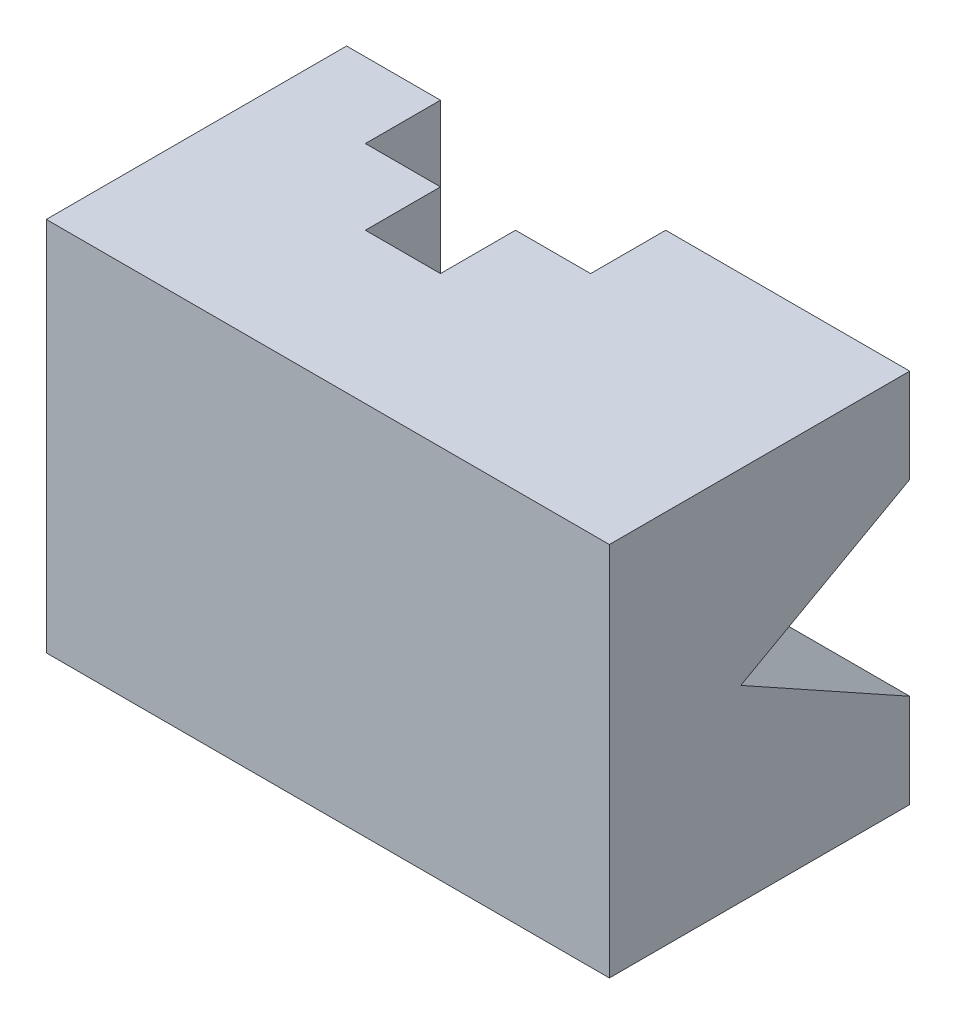
ISO-10303-21;
HEADER;
FILE_DESCRIPTION(('STEP AP214'),'2;1');
FILE_NAME('part.step','',(''),(''),'','','');
FILE_SCHEMA(('AUTOMOTIVE_DESIGN { 1 0 10303 214 1 1 1 1 }'));
ENDSEC;
DATA;
#1=APPLICATION_CONTEXT('core data for automotive mechanical design processes');
#2=APPLICATION_PROTOCOL_DEFINITION('international standard','automotive_design',2000,#1);
#3=PRODUCT_CONTEXT('',#1,'mechanical');
#4=PRODUCT('Part','Part','',(#3));
#5=PRODUCT_RELATED_PRODUCT_CATEGORY('part','',(#4));
#6=PRODUCT_DEFINITION_FORMATION('','',#4);
#7=PRODUCT_DEFINITION_CONTEXT('part definition',#1,'design');
#8=PRODUCT_DEFINITION('design','',#6,#7);
#9=PRODUCT_DEFINITION_SHAPE('','',#8);
#10=(LENGTH_UNIT() NAMED_UNIT(*) SI_UNIT(.MILLI.,.METRE.));
#11=(NAMED_UNIT(*) PLANE_ANGLE_UNIT() SI_UNIT($,.RADIAN.));
#12=(NAMED_UNIT(*) SI_UNIT($,.STERADIAN.) SOLID_ANGLE_UNIT());
#13=UNCERTAINTY_MEASURE_WITH_UNIT(LENGTH_MEASURE(1.E-05),#10,'distance_accuracy_value','');
#14=(GEOMETRIC_REPRESENTATION_CONTEXT(3) GLOBAL_UNCERTAINTY_ASSIGNED_CONTEXT((#13)) GLOBAL_UNIT_ASSIGNED_CONTEXT((#10,
#11,#12)) REPRESENTATION_CONTEXT('',''));
#15=CARTESIAN_POINT('',(0.,0.,0.));
#16=DIRECTION('',(0.,0.,1.));
#17=DIRECTION('',(1.,0.,0.));
#18=AXIS2_PLACEMENT_3D('',#15,#16,#17);
#19=CARTESIAN_POINT('',(9.99999999999998,100.,0.));
#20=DIRECTION('',(-1.,0.,0.));
#21=DIRECTION('',(0.,0.,1.));
#22=AXIS2_PLACEMENT_3D('',#19,#20,#21);
#23=PLANE('',#22);
#24=DIRECTION('',(0.,0.,-1.));
#25=VECTOR('',#24,1.);
#26=CARTESIAN_POINT('',(9.99999999999998,0.,0.));
#27=LINE('',#26,#25);
#28=CARTESIAN_POINT('',(9.99999999999999,0.,-20.));
#29=VERTEX_POINT('',#28);
#30=CARTESIAN_POINT('',(9.99999999999999,0.,-40.));
#31=VERTEX_POINT('',#30);
#32=EDGE_CURVE('E184',#29,#31,#27,.T.);
#33=ORIENTED_EDGE('',*,*,#32,.F.);
#34=DIRECTION('',(0.,-1.,0.));
#35=VECTOR('',#34,1.);
#36=CARTESIAN_POINT('',(9.99999999999999,100.,-20.));
#37=LINE('',#36,#35);
#38=CARTESIAN_POINT('',(9.99999999999999,100.,-20.));
#39=VERTEX_POINT('',#38);
#40=EDGE_CURVE('E11',#39,#29,#37,.T.);
#41=ORIENTED_EDGE('',*,*,#40,.F.);
#42=DIRECTION('',(0.,0.,-1.));
#43=VECTOR('',#42,1.);
#44=CARTESIAN_POINT('',(9.99999999999998,100.,0.));
#45=LINE('',#44,#43);
#46=CARTESIAN_POINT('',(9.99999999999999,100.,-40.));
#47=VERTEX_POINT('',#46);
#48=EDGE_CURVE('E280',#39,#47,#45,.T.);
#49=ORIENTED_EDGE('',*,*,#48,.T.);
#50=DIRECTION('',(0.,-1.,0.));
#51=VECTOR('',#50,1.);
#52=CARTESIAN_POINT('',(9.99999999999999,100.,-40.));
#53=LINE('',#52,#51);
#54=EDGE_CURVE('E69',#47,#31,#53,.T.);
#55=ORIENTED_EDGE('',*,*,#54,.T.);
#56=EDGE_LOOP('',(#33,#41,#49,#55));
#57=FACE_BOUND('',#56,.T.);
#58=ADVANCED_FACE('F45',(#57),#23,.T.);
#59=CARTESIAN_POINT('',(0.,100.,-20.));
#60=DIRECTION('',(0.,0.,-1.));
#61=DIRECTION('',(-1.,0.,0.));
#62=AXIS2_PLACEMENT_3D('',#59,#60,#61);
#63=PLANE('',#62);
#64=DIRECTION('',(1.,0.,0.));
#65=VECTOR('',#64,1.);
#66=CARTESIAN_POINT('',(0.,0.,-20.));
#67=LINE('',#66,#65);
#68=CARTESIAN_POINT('',(-10.,0.,-20.));
#69=VERTEX_POINT('',#68);
#70=EDGE_CURVE('E187',#69,#29,#67,.T.);
#71=ORIENTED_EDGE('',*,*,#70,.F.);
#72=DIRECTION('',(0.,-1.,0.));
#73=VECTOR('',#72,1.);
#74=CARTESIAN_POINT('',(-10.,100.,-20.));
#75=LINE('',#74,#73);
#76=CARTESIAN_POINT('',(-10.,100.,-20.));
#77=VERTEX_POINT('',#76);
#78=EDGE_CURVE('E53',#77,#69,#75,.T.);
#79=ORIENTED_EDGE('',*,*,#78,.F.);
#80=DIRECTION('',(1.,0.,0.));
#81=VECTOR('',#80,1.);
#82=CARTESIAN_POINT('',(0.,100.,-20.));
#83=LINE('',#82,#81);
#84=EDGE_CURVE('E273',#77,#39,#83,.T.);
#85=ORIENTED_EDGE('',*,*,#84,.T.);
#86=ORIENTED_EDGE('',*,*,#40,.T.);
#87=EDGE_LOOP('',(#71,#79,#85,#86));
#88=FACE_BOUND('',#87,.T.);
#89=ADVANCED_FACE('F261',(#88),#63,.T.);
#90=CARTESIAN_POINT('',(-10.,100.,0.));
#91=DIRECTION('',(-1.,0.,0.));
#92=DIRECTION('',(0.,0.,1.));
#93=AXIS2_PLACEMENT_3D('',#90,#91,#92);
#94=PLANE('',#93);
#95=DIRECTION('',(0.,0.,-1.));
#96=VECTOR('',#95,1.);
#97=CARTESIAN_POINT('',(-10.,0.,0.));
#98=LINE('',#97,#96);
#99=CARTESIAN_POINT('',(-10.,0.,0.));
#100=VERTEX_POINT('',#99);
#101=EDGE_CURVE('E192',#100,#69,#98,.T.);
#102=ORIENTED_EDGE('',*,*,#101,.F.);
#103=DIRECTION('',(0.,-1.,0.));
#104=VECTOR('',#103,1.);
#105=CARTESIAN_POINT('',(-10.,100.,0.));
#106=LINE('',#105,#104);
#107=CARTESIAN_POINT('',(-10.,100.,0.));
#108=VERTEX_POINT('',#107);
#109=EDGE_CURVE('E248',#108,#100,#106,.T.);
#110=ORIENTED_EDGE('',*,*,#109,.F.);
#111=DIRECTION('',(0.,0.,-1.));
#112=VECTOR('',#111,1.);
#113=CARTESIAN_POINT('',(-10.,100.,0.));
#114=LINE('',#113,#112);
#115=EDGE_CURVE('E257',#108,#77,#114,.T.);
#116=ORIENTED_EDGE('',*,*,#115,.T.);
#117=ORIENTED_EDGE('',*,*,#78,.T.);
#118=EDGE_LOOP('',(#102,#110,#116,#117));
#119=FACE_BOUND('',#118,.T.);
#120=ADVANCED_FACE('F255',(#119),#94,.T.);
#121=CARTESIAN_POINT('',(0.,100.,0.));
#122=DIRECTION('',(0.,0.,-1.));
#123=DIRECTION('',(-1.,0.,0.));
#124=AXIS2_PLACEMENT_3D('',#121,#122,#123);
#125=PLANE('',#124);
#126=DIRECTION('',(1.,0.,0.));
#127=VECTOR('',#126,1.);
#128=CARTESIAN_POINT('',(0.,0.,0.));
#129=LINE('',#128,#127);
#130=CARTESIAN_POINT('',(-30.,0.,0.));
#131=VERTEX_POINT('',#130);
#132=EDGE_CURVE('E196',#131,#100,#129,.T.);
#133=ORIENTED_EDGE('',*,*,#132,.F.);
#134=DIRECTION('',(0.,-1.,0.));
#135=VECTOR('',#134,1.);
#136=CARTESIAN_POINT('',(-30.,100.,0.));
#137=LINE('',#136,#135);
#138=CARTESIAN_POINT('',(-30.,100.,0.));
#139=VERTEX_POINT('',#138);
#140=EDGE_CURVE('E245',#139,#131,#137,.T.);
#141=ORIENTED_EDGE('',*,*,#140,.F.);
#142=DIRECTION('',(1.,0.,0.));
#143=VECTOR('',#142,1.);
#144=CARTESIAN_POINT('',(0.,100.,0.));
#145=LINE('',#144,#143);
#146=EDGE_CURVE('E270',#139,#108,#145,.T.);
#147=ORIENTED_EDGE('',*,*,#146,.T.);
#148=ORIENTED_EDGE('',*,*,#109,.T.);
#149=EDGE_LOOP('',(#133,#141,#147,#148));
#150=FACE_BOUND('',#149,.T.);
#151=ADVANCED_FACE('F267',(#150),#125,.T.);
#152=CARTESIAN_POINT('',(-30.,100.,0.));
#153=DIRECTION('',(1.,0.,0.));
#154=DIRECTION('',(0.,0.,-1.));
#155=AXIS2_PLACEMENT_3D('',#152,#153,#154);
#156=PLANE('',#155);
#157=DIRECTION('',(0.,0.,1.));
#158=VECTOR('',#157,1.);
#159=CARTESIAN_POINT('',(-30.,0.,0.));
#160=LINE('',#159,#158);
#161=CARTESIAN_POINT('',(-30.,0.,-20.));
#162=VERTEX_POINT('',#161);
#163=EDGE_CURVE('E200',#162,#131,#160,.T.);
#164=ORIENTED_EDGE('',*,*,#163,.F.);
#165=DIRECTION('',(0.,-1.,0.));
#166=VECTOR('',#165,1.);
#167=CARTESIAN_POINT('',(-30.,100.,-20.));
#168=LINE('',#167,#166);
#169=CARTESIAN_POINT('',(-30.,100.,-20.));
#170=VERTEX_POINT('',#169);
#171=EDGE_CURVE('E242',#170,#162,#168,.T.);
#172=ORIENTED_EDGE('',*,*,#171,.F.);
#173=DIRECTION('',(0.,0.,1.));
#174=VECTOR('',#173,1.);
#175=CARTESIAN_POINT('',(-30.,100.,0.));
#176=LINE('',#175,#174);
#177=EDGE_CURVE('E278',#170,#139,#176,.T.);
#178=ORIENTED_EDGE('',*,*,#177,.T.);
#179=ORIENTED_EDGE('',*,*,#140,.T.);
#180=EDGE_LOOP('',(#164,#172,#178,#179));
#181=FACE_BOUND('',#180,.T.);
#182=ADVANCED_FACE('F368',(#181),#156,.T.);
#183=CARTESIAN_POINT('',(0.,100.,-20.));
#184=DIRECTION('',(0.,0.,-1.));
#185=DIRECTION('',(-1.,0.,0.));
#186=AXIS2_PLACEMENT_3D('',#183,#184,#185);
#187=PLANE('',#186);
#188=DIRECTION('',(1.,0.,0.));
#189=VECTOR('',#188,1.);
#190=CARTESIAN_POINT('',(0.,0.,-20.));
#191=LINE('',#190,#189);
#192=CARTESIAN_POINT('',(-50.,0.,-20.));
#193=VERTEX_POINT('',#192);
#194=EDGE_CURVE('E204',#193,#162,#191,.T.);
#195=ORIENTED_EDGE('',*,*,#194,.F.);
#196=DIRECTION('',(0.,-1.,0.));
#197=VECTOR('',#196,1.);
#198=CARTESIAN_POINT('',(-50.,100.,-20.));
#199=LINE('',#198,#197);
#200=CARTESIAN_POINT('',(-50.,100.,-20.));
#201=VERTEX_POINT('',#200);
#202=EDGE_CURVE('E239',#201,#193,#199,.T.);
#203=ORIENTED_EDGE('',*,*,#202,.F.);
#204=DIRECTION('',(1.,0.,0.));
#205=VECTOR('',#204,1.);
#206=CARTESIAN_POINT('',(0.,100.,-20.));
#207=LINE('',#206,#205);
#208=EDGE_CURVE('E286',#201,#170,#207,.T.);
#209=ORIENTED_EDGE('',*,*,#208,.T.);
#210=ORIENTED_EDGE('',*,*,#171,.T.);
#211=EDGE_LOOP('',(#195,#203,#209,#210));
#212=FACE_BOUND('',#211,.T.);
#213=ADVANCED_FACE('F371',(#212),#187,.T.);
#214=CARTESIAN_POINT('',(-50.,100.,0.));
#215=DIRECTION('',(1.,0.,0.));
#216=DIRECTION('',(0.,0.,-1.));
#217=AXIS2_PLACEMENT_3D('',#214,#215,#216);
#218=PLANE('',#217);
#219=DIRECTION('',(0.,0.,1.));
#220=VECTOR('',#219,1.);
#221=CARTESIAN_POINT('',(-50.,0.,0.));
#222=LINE('',#221,#220);
#223=CARTESIAN_POINT('',(-50.,0.,-40.));
#224=VERTEX_POINT('',#223);
#225=EDGE_CURVE('E208',#224,#193,#222,.T.);
#226=ORIENTED_EDGE('',*,*,#225,.F.);
#227=DIRECTION('',(0.,-1.,0.));
#228=VECTOR('',#227,1.);
#229=CARTESIAN_POINT('',(-50.,100.,-40.));
#230=LINE('',#229,#228);
#231=CARTESIAN_POINT('',(-50.,100.,-40.));
#232=VERTEX_POINT('',#231);
#233=EDGE_CURVE('E236',#232,#224,#230,.T.);
#234=ORIENTED_EDGE('',*,*,#233,.F.);
#235=DIRECTION('',(0.,0.,1.));
#236=VECTOR('',#235,1.);
#237=CARTESIAN_POINT('',(-50.,100.,0.));
#238=LINE('',#237,#236);
#239=EDGE_CURVE('E290',#232,#201,#238,.T.);
#240=ORIENTED_EDGE('',*,*,#239,.T.);
#241=ORIENTED_EDGE('',*,*,#202,.T.);
#242=EDGE_LOOP('',(#226,#234,#240,#241));
#243=FACE_BOUND('',#242,.T.);
#244=ADVANCED_FACE('F375',(#243),#218,.T.);
#245=CARTESIAN_POINT('',(0.,100.,-40.));
#246=DIRECTION('',(0.,0.,-1.));
#247=DIRECTION('',(-1.,0.,0.));
#248=AXIS2_PLACEMENT_3D('',#245,#246,#247);
#249=PLANE('',#248);
#250=DIRECTION('',(1.,0.,0.));
#251=VECTOR('',#250,1.);
#252=CARTESIAN_POINT('',(0.,0.,-40.));
#253=LINE('',#252,#251);
#254=CARTESIAN_POINT('',(-75.,0.,-40.));
#255=VERTEX_POINT('',#254);
#256=EDGE_CURVE('E212',#255,#224,#253,.T.);
#257=ORIENTED_EDGE('',*,*,#256,.F.);
#258=DIRECTION('',(0.,-1.,0.));
#259=VECTOR('',#258,1.);
#260=CARTESIAN_POINT('',(-75.,100.,-40.));
#261=LINE('',#260,#259);
#262=CARTESIAN_POINT('',(-75.,100.,-40.));
#263=VERTEX_POINT('',#262);
#264=EDGE_CURVE('E233',#263,#255,#261,.T.);
#265=ORIENTED_EDGE('',*,*,#264,.F.);
#266=DIRECTION('',(1.,0.,0.));
#267=VECTOR('',#266,1.);
#268=CARTESIAN_POINT('',(0.,100.,-40.));
#269=LINE('',#268,#267);
#270=EDGE_CURVE('E181',#263,#232,#269,.T.);
#271=ORIENTED_EDGE('',*,*,#270,.T.);
#272=ORIENTED_EDGE('',*,*,#233,.T.);
#273=EDGE_LOOP('',(#257,#265,#271,#272));
#274=FACE_BOUND('',#273,.T.);
#275=ADVANCED_FACE('F379',(#274),#249,.T.);
#276=CARTESIAN_POINT('',(-75.,100.,0.));
#277=DIRECTION('',(-1.,0.,0.));
#278=DIRECTION('',(0.,0.,1.));
#279=AXIS2_PLACEMENT_3D('',#276,#277,#278);
#280=PLANE('',#279);
#281=DIRECTION('',(0.,0.,-1.));
#282=VECTOR('',#281,1.);
#283=CARTESIAN_POINT('',(-75.,0.,0.));
#284=LINE('',#283,#282);
#285=CARTESIAN_POINT('',(-75.,0.,40.));
#286=VERTEX_POINT('',#285);
#287=EDGE_CURVE('E216',#286,#255,#284,.T.);
#288=ORIENTED_EDGE('',*,*,#287,.F.);
#289=DIRECTION('',(0.,-1.,0.));
#290=VECTOR('',#289,1.);
#291=CARTESIAN_POINT('',(-75.,100.,40.));
#292=LINE('',#291,#290);
#293=CARTESIAN_POINT('',(-75.,100.,40.));
#294=VERTEX_POINT('',#293);
#295=EDGE_CURVE('E169',#294,#286,#292,.T.);
#296=ORIENTED_EDGE('',*,*,#295,.F.);
#297=DIRECTION('',(0.,0.,-1.));
#298=VECTOR('',#297,1.);
#299=CARTESIAN_POINT('',(-75.,100.,0.));
#300=LINE('',#299,#298);
#301=EDGE_CURVE('E156',#294,#263,#300,.T.);
#302=ORIENTED_EDGE('',*,*,#301,.T.);
#303=ORIENTED_EDGE('',*,*,#264,.T.);
#304=EDGE_LOOP('',(#288,#296,#302,#303));
#305=FACE_BOUND('',#304,.T.);
#306=ADVANCED_FACE('F298',(#305),#280,.T.);
#307=CARTESIAN_POINT('',(0.,100.,40.));
#308=DIRECTION('',(0.,0.,-1.));
#309=DIRECTION('',(-1.,0.,0.));
#310=AXIS2_PLACEMENT_3D('',#307,#308,#309);
#311=PLANE('',#310);
#312=DIRECTION('',(1.,0.,0.));
#313=VECTOR('',#312,1.);
#314=CARTESIAN_POINT('',(0.,0.,40.));
#315=LINE('',#314,#313);
#316=CARTESIAN_POINT('',(75.,0.,40.));
#317=VERTEX_POINT('',#316);
#318=EDGE_CURVE('E164',#286,#317,#315,.T.);
#319=ORIENTED_EDGE('',*,*,#318,.T.);
#320=DIRECTION('',(0.,-1.,0.));
#321=VECTOR('',#320,1.);
#322=CARTESIAN_POINT('',(75.,100.,40.));
#323=LINE('',#322,#321);
#324=CARTESIAN_POINT('',(75.,100.,40.));
#325=VERTEX_POINT('',#324);
#326=EDGE_CURVE('E161',#325,#317,#323,.T.);
#327=ORIENTED_EDGE('',*,*,#326,.F.);
#328=DIRECTION('',(1.,0.,0.));
#329=VECTOR('',#328,1.);
#330=CARTESIAN_POINT('',(0.,100.,40.));
#331=LINE('',#330,#329);
#332=EDGE_CURVE('E147',#294,#325,#331,.T.);
#333=ORIENTED_EDGE('',*,*,#332,.F.);
#334=ORIENTED_EDGE('',*,*,#295,.T.);
#335=EDGE_LOOP('',(#319,#327,#333,#334));
#336=FACE_BOUND('',#335,.T.);
#337=ADVANCED_FACE('F162',(#336),#311,.F.);
#338=CARTESIAN_POINT('',(75.,100.,0.));
#339=DIRECTION('',(-1.,0.,0.));
#340=DIRECTION('',(0.,0.,1.));
#341=AXIS2_PLACEMENT_3D('',#338,#339,#340);
#342=PLANE('',#341);
#343=DIRECTION('',(0.,-1.,0.));
#344=VECTOR('',#343,1.);
#345=CARTESIAN_POINT('',(75.,100.,-40.));
#346=LINE('',#345,#344);
#347=CARTESIAN_POINT('',(75.,25.,-40.));
#348=VERTEX_POINT('',#347);
#349=CARTESIAN_POINT('',(75.,0.,-40.));
#350=VERTEX_POINT('',#349);
#351=EDGE_CURVE('E228',#348,#350,#346,.T.);
#352=ORIENTED_EDGE('',*,*,#351,.F.);
#353=DIRECTION('',(0.,-0.485642931178632,-0.874157276121538));
#354=VECTOR('',#353,1.);
#355=CARTESIAN_POINT('',(75.,25.,-40.));
#356=LINE('',#355,#354);
#357=CARTESIAN_POINT('',(75.,50.,5.00000000000001));
#358=VERTEX_POINT('',#357);
#359=EDGE_CURVE('E304',#358,#348,#356,.T.);
#360=ORIENTED_EDGE('',*,*,#359,.F.);
#361=DIRECTION('',(0.,-0.485642931178632,0.874157276121538));
#362=VECTOR('',#361,1.);
#363=CARTESIAN_POINT('',(75.,75.,-40.));
#364=LINE('',#363,#362);
#365=CARTESIAN_POINT('',(75.,75.,-40.));
#366=VERTEX_POINT('',#365);
#367=EDGE_CURVE('E343',#366,#358,#364,.T.);
#368=ORIENTED_EDGE('',*,*,#367,.F.);
#369=CARTESIAN_POINT('',(75.,100.,-40.));
#370=VERTEX_POINT('',#369);
#371=EDGE_CURVE('E170',#370,#366,#346,.T.);
#372=ORIENTED_EDGE('',*,*,#371,.F.);
#373=DIRECTION('',(0.,0.,-1.));
#374=VECTOR('',#373,1.);
#375=CARTESIAN_POINT('',(75.,100.,0.));
#376=LINE('',#375,#374);
#377=EDGE_CURVE('E152',#325,#370,#376,.T.);
#378=ORIENTED_EDGE('',*,*,#377,.F.);
#379=ORIENTED_EDGE('',*,*,#326,.T.);
#380=DIRECTION('',(0.,0.,-1.));
#381=VECTOR('',#380,1.);
#382=CARTESIAN_POINT('',(75.,0.,0.));
#383=LINE('',#382,#381);
#384=EDGE_CURVE('E223',#317,#350,#383,.T.);
#385=ORIENTED_EDGE('',*,*,#384,.T.);
#386=EDGE_LOOP('',(#352,#360,#368,#372,#378,#379,#385));
#387=FACE_BOUND('',#386,.T.);
#388=ADVANCED_FACE('F173',(#387),#342,.F.);
#389=DIRECTION('',(1.,0.,0.));
#390=VECTOR('',#389,1.);
#391=CARTESIAN_POINT('',(25.,25.,-40.));
#392=LINE('',#391,#390);
#393=CARTESIAN_POINT('',(25.,25.,-40.));
#394=VERTEX_POINT('',#393);
#395=EDGE_CURVE('E188',#394,#348,#392,.T.);
#396=ORIENTED_EDGE('',*,*,#395,.T.);
#397=ORIENTED_EDGE('',*,*,#351,.T.);
#398=EDGE_CURVE('E217',#31,#350,#253,.T.);
#399=ORIENTED_EDGE('',*,*,#398,.F.);
#400=ORIENTED_EDGE('',*,*,#54,.F.);
#401=EDGE_CURVE('E177',#47,#370,#269,.T.);
#402=ORIENTED_EDGE('',*,*,#401,.T.);
#403=ORIENTED_EDGE('',*,*,#371,.T.);
#404=DIRECTION('',(1.,0.,0.));
#405=VECTOR('',#404,1.);
#406=CARTESIAN_POINT('',(25.,75.,-40.));
#407=LINE('',#406,#405);
#408=CARTESIAN_POINT('',(25.,75.,-40.));
#409=VERTEX_POINT('',#408);
#410=EDGE_CURVE('E318',#409,#366,#407,.T.);
#411=ORIENTED_EDGE('',*,*,#410,.F.);
#412=DIRECTION('',(0.,1.,0.));
#413=VECTOR('',#412,1.);
#414=CARTESIAN_POINT('',(25.,25.,-40.));
#415=LINE('',#414,#413);
#416=EDGE_CURVE('E311',#394,#409,#415,.T.);
#417=ORIENTED_EDGE('',*,*,#416,.F.);
#418=EDGE_LOOP('',(#396,#397,#399,#400,#402,#403,#411,#417));
#419=FACE_BOUND('',#418,.T.);
#420=ADVANCED_FACE('F308',(#419),#249,.T.);
#421=CARTESIAN_POINT('',(0.,100.,0.));
#422=DIRECTION('',(0.,1.,0.));
#423=DIRECTION('',(0.,0.,1.));
#424=AXIS2_PLACEMENT_3D('',#421,#422,#423);
#425=PLANE('',#424);
#426=ORIENTED_EDGE('',*,*,#48,.F.);
#427=ORIENTED_EDGE('',*,*,#84,.F.);
#428=ORIENTED_EDGE('',*,*,#115,.F.);
#429=ORIENTED_EDGE('',*,*,#146,.F.);
#430=ORIENTED_EDGE('',*,*,#177,.F.);
#431=ORIENTED_EDGE('',*,*,#208,.F.);
#432=ORIENTED_EDGE('',*,*,#239,.F.);
#433=ORIENTED_EDGE('',*,*,#270,.F.);
#434=ORIENTED_EDGE('',*,*,#301,.F.);
#435=ORIENTED_EDGE('',*,*,#332,.T.);
#436=ORIENTED_EDGE('',*,*,#377,.T.);
#437=ORIENTED_EDGE('',*,*,#401,.F.);
#438=EDGE_LOOP('',(#426,#427,#428,#429,#430,#431,#432,#433,#434,#435,#436,#437));
#439=FACE_BOUND('',#438,.T.);
#440=ADVANCED_FACE('F149',(#439),#425,.T.);
#441=CARTESIAN_POINT('',(0.,0.,0.));
#442=DIRECTION('',(0.,1.,0.));
#443=DIRECTION('',(0.,0.,1.));
#444=AXIS2_PLACEMENT_3D('',#441,#442,#443);
#445=PLANE('',#444);
#446=ORIENTED_EDGE('',*,*,#32,.T.);
#447=ORIENTED_EDGE('',*,*,#398,.T.);
#448=ORIENTED_EDGE('',*,*,#384,.F.);
#449=ORIENTED_EDGE('',*,*,#318,.F.);
#450=ORIENTED_EDGE('',*,*,#287,.T.);
#451=ORIENTED_EDGE('',*,*,#256,.T.);
#452=ORIENTED_EDGE('',*,*,#225,.T.);
#453=ORIENTED_EDGE('',*,*,#194,.T.);
#454=ORIENTED_EDGE('',*,*,#163,.T.);
#455=ORIENTED_EDGE('',*,*,#132,.T.);
#456=ORIENTED_EDGE('',*,*,#101,.T.);
#457=ORIENTED_EDGE('',*,*,#70,.T.);
#458=EDGE_LOOP('',(#446,#447,#448,#449,#450,#451,#452,#453,#454,#455,#456,#457));
#459=FACE_BOUND('',#458,.T.);
#460=ADVANCED_FACE('F263',(#459),#445,.F.);
#461=CARTESIAN_POINT('',(25.,25.,-40.));
#462=DIRECTION('',(0.,-0.874157276121538,0.485642931178632));
#463=DIRECTION('',(0.,-0.485642931178632,-0.874157276121538));
#464=AXIS2_PLACEMENT_3D('',#461,#462,#463);
#465=PLANE('',#464);
#466=ORIENTED_EDGE('',*,*,#359,.T.);
#467=ORIENTED_EDGE('',*,*,#395,.F.);
#468=DIRECTION('',(0.,-0.485642931178632,-0.874157276121538));
#469=VECTOR('',#468,1.);
#470=CARTESIAN_POINT('',(25.,25.,-40.));
#471=LINE('',#470,#469);
#472=CARTESIAN_POINT('',(25.,50.,5.00000000000001));
#473=VERTEX_POINT('',#472);
#474=EDGE_CURVE('E60',#473,#394,#471,.T.);
#475=ORIENTED_EDGE('',*,*,#474,.F.);
#476=DIRECTION('',(1.,0.,0.));
#477=VECTOR('',#476,1.);
#478=CARTESIAN_POINT('',(25.,50.,5.00000000000001));
#479=LINE('',#478,#477);
#480=EDGE_CURVE('E314',#473,#358,#479,.T.);
#481=ORIENTED_EDGE('',*,*,#480,.T.);
#482=EDGE_LOOP('',(#466,#467,#475,#481));
#483=FACE_BOUND('',#482,.T.);
#484=ADVANCED_FACE('F347',(#483),#465,.F.);
#485=CARTESIAN_POINT('',(25.,75.,-40.));
#486=DIRECTION('',(0.,0.874157276121538,0.485642931178632));
#487=DIRECTION('',(0.,-0.485642931178632,0.874157276121538));
#488=AXIS2_PLACEMENT_3D('',#485,#486,#487);
#489=PLANE('',#488);
#490=ORIENTED_EDGE('',*,*,#367,.T.);
#491=ORIENTED_EDGE('',*,*,#480,.F.);
#492=DIRECTION('',(0.,-0.485642931178632,0.874157276121538));
#493=VECTOR('',#492,1.);
#494=CARTESIAN_POINT('',(25.,75.,-40.));
#495=LINE('',#494,#493);
#496=EDGE_CURVE('E335',#409,#473,#495,.T.);
#497=ORIENTED_EDGE('',*,*,#496,.F.);
#498=ORIENTED_EDGE('',*,*,#410,.T.);
#499=EDGE_LOOP('',(#490,#491,#497,#498));
#500=FACE_BOUND('',#499,.T.);
#501=ADVANCED_FACE('F336',(#500),#489,.F.);
#502=CARTESIAN_POINT('',(25.,0.,0.));
#503=DIRECTION('',(1.,0.,0.));
#504=DIRECTION('',(0.,0.,-1.));
#505=AXIS2_PLACEMENT_3D('',#502,#503,#504);
#506=PLANE('',#505);
#507=ORIENTED_EDGE('',*,*,#416,.T.);
#508=ORIENTED_EDGE('',*,*,#496,.T.);
#509=ORIENTED_EDGE('',*,*,#474,.T.);
#510=EDGE_LOOP('',(#507,#508,#509));
#511=FACE_BOUND('',#510,.T.);
#512=ADVANCED_FACE('F339',(#511),#506,.T.);
#513=CLOSED_SHELL('',(#58,#89,#120,#151,#182,#213,#244,#275,#306,#337,#388,#420,#440,#460,#484,
#501,#512));
#514=MANIFOLD_SOLID_BREP('B2',#513);
#515=ADVANCED_BREP_SHAPE_REPRESENTATION('',(#18,#514),#14);
#516=SHAPE_DEFINITION_REPRESENTATION(#9,#515);
ENDSEC;
END-ISO-10303-21;
